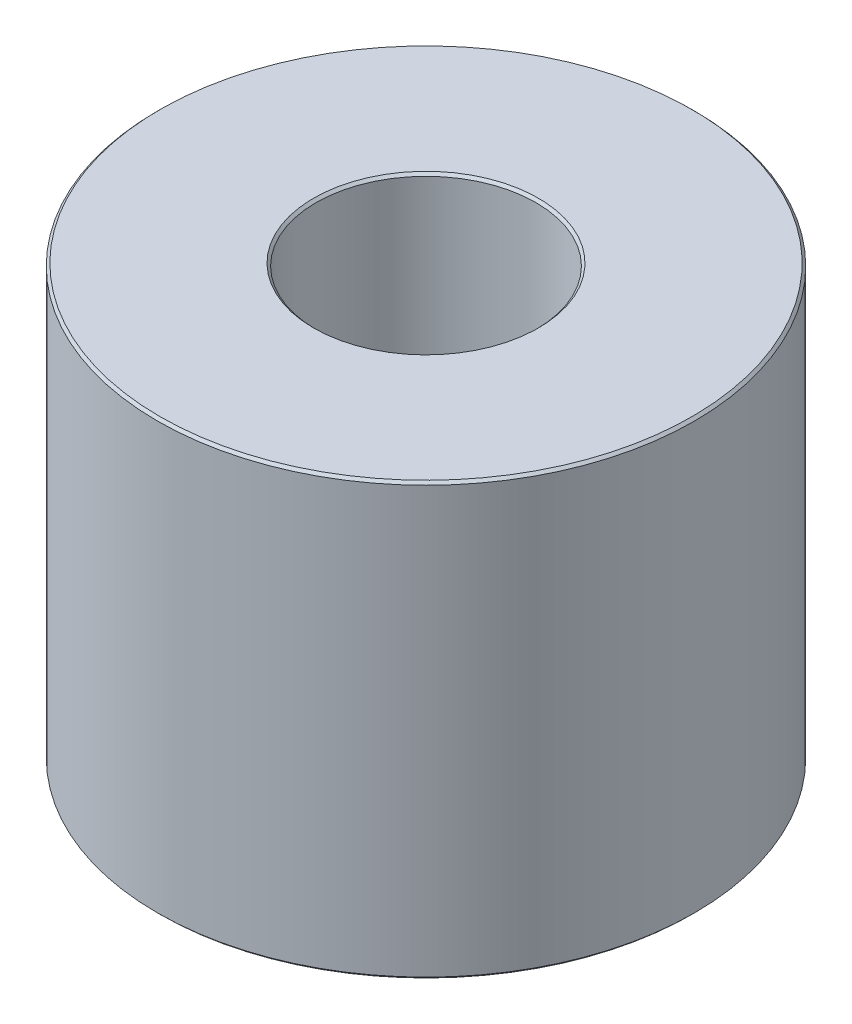
ISO-10303-21;
HEADER;
FILE_DESCRIPTION(('STEP AP214'),'2;1');
FILE_NAME('part.step','',(''),(''),'','','');
FILE_SCHEMA(('AUTOMOTIVE_DESIGN { 1 0 10303 214 1 1 1 1 }'));
ENDSEC;
DATA;
#1=APPLICATION_CONTEXT('core data for automotive mechanical design processes');
#2=APPLICATION_PROTOCOL_DEFINITION('international standard','automotive_design',2000,#1);
#3=PRODUCT_CONTEXT('',#1,'mechanical');
#4=PRODUCT('Part','Part','',(#3));
#5=PRODUCT_RELATED_PRODUCT_CATEGORY('part','',(#4));
#6=PRODUCT_DEFINITION_FORMATION('','',#4);
#7=PRODUCT_DEFINITION_CONTEXT('part definition',#1,'design');
#8=PRODUCT_DEFINITION('design','',#6,#7);
#9=PRODUCT_DEFINITION_SHAPE('','',#8);
#10=(LENGTH_UNIT() NAMED_UNIT(*) SI_UNIT(.MILLI.,.METRE.));
#11=(NAMED_UNIT(*) PLANE_ANGLE_UNIT() SI_UNIT($,.RADIAN.));
#12=(NAMED_UNIT(*) SI_UNIT($,.STERADIAN.) SOLID_ANGLE_UNIT());
#13=UNCERTAINTY_MEASURE_WITH_UNIT(LENGTH_MEASURE(1.E-05),#10,'distance_accuracy_value','');
#14=(GEOMETRIC_REPRESENTATION_CONTEXT(3) GLOBAL_UNCERTAINTY_ASSIGNED_CONTEXT((#13)) GLOBAL_UNIT_ASSIGNED_CONTEXT((#10,
#11,#12)) REPRESENTATION_CONTEXT('',''));
#15=CARTESIAN_POINT('',(0.,0.,0.));
#16=DIRECTION('',(0.,0.,1.));
#17=DIRECTION('',(1.,0.,0.));
#18=AXIS2_PLACEMENT_3D('',#15,#16,#17);
#19=CARTESIAN_POINT('',(0.,84.2794132997244,0.));
#20=DIRECTION('',(0.,-1.,0.));
#21=DIRECTION('',(0.,0.,-1.));
#22=AXIS2_PLACEMENT_3D('',#19,#20,#21);
#23=CYLINDRICAL_SURFACE('',#22,52.5);
#24=CARTESIAN_POINT('',(0.,0.495466436711306,0.));
#25=DIRECTION('',(0.,1.,0.));
#26=DIRECTION('',(0.,0.,1.));
#27=AXIS2_PLACEMENT_3D('',#24,#25,#26);
#28=CIRCLE('',#27,52.5);
#29=CARTESIAN_POINT('',(0.,0.495466436711306,52.5));
#30=VERTEX_POINT('',#29);
#31=EDGE_CURVE('E10',#30,#30,#28,.T.);
#32=ORIENTED_EDGE('',*,*,#31,.T.);
#33=EDGE_LOOP('',(#32));
#34=FACE_BOUND('',#33,.T.);
#35=CARTESIAN_POINT('',(0.,83.783946863013,0.));
#36=DIRECTION('',(0.,1.,0.));
#37=DIRECTION('',(0.,0.,1.));
#38=AXIS2_PLACEMENT_3D('',#35,#36,#37);
#39=CIRCLE('',#38,52.5);
#40=CARTESIAN_POINT('',(0.,83.783946863013,52.5));
#41=VERTEX_POINT('',#40);
#42=EDGE_CURVE('E50',#41,#41,#39,.F.);
#43=ORIENTED_EDGE('',*,*,#42,.T.);
#44=EDGE_LOOP('',(#43));
#45=FACE_BOUND('',#44,.T.);
#46=ADVANCED_FACE('F39',(#34,#45),#23,.T.);
#47=CARTESIAN_POINT('',(0.,84.2794132997244,0.));
#48=DIRECTION('',(0.,1.,0.));
#49=DIRECTION('',(0.,0.,1.));
#50=AXIS2_PLACEMENT_3D('',#47,#48,#49);
#51=PLANE('',#50);
#52=CARTESIAN_POINT('',(0.,84.2794132997244,0.));
#53=DIRECTION('',(0.,1.,0.));
#54=DIRECTION('',(0.,0.,1.));
#55=AXIS2_PLACEMENT_3D('',#52,#53,#54);
#56=CIRCLE('',#55,21.985822478448);
#57=CARTESIAN_POINT('',(0.,84.2794132997244,21.985822478448));
#58=VERTEX_POINT('',#57);
#59=EDGE_CURVE('E58',#58,#58,#56,.F.);
#60=ORIENTED_EDGE('',*,*,#59,.T.);
#61=EDGE_LOOP('',(#60));
#62=FACE_BOUND('',#61,.T.);
#63=CARTESIAN_POINT('',(0.,84.2794132997244,0.));
#64=DIRECTION('',(0.,1.,0.));
#65=DIRECTION('',(0.,0.,1.));
#66=AXIS2_PLACEMENT_3D('',#63,#64,#65);
#67=CIRCLE('',#66,52.0045335632887);
#68=CARTESIAN_POINT('',(0.,84.2794132997244,52.0045335632887));
#69=VERTEX_POINT('',#68);
#70=EDGE_CURVE('E61',#69,#69,#67,.T.);
#71=ORIENTED_EDGE('',*,*,#70,.T.);
#72=EDGE_LOOP('',(#71));
#73=FACE_BOUND('',#72,.T.);
#74=ADVANCED_FACE('F88',(#62,#73),#51,.T.);
#75=CARTESIAN_POINT('',(0.,0.,0.));
#76=DIRECTION('',(0.,1.,0.));
#77=DIRECTION('',(0.,0.,1.));
#78=AXIS2_PLACEMENT_3D('',#75,#76,#77);
#79=PLANE('',#78);
#80=CARTESIAN_POINT('',(0.,0.,0.));
#81=DIRECTION('',(0.,1.,0.));
#82=DIRECTION('',(0.,0.,1.));
#83=AXIS2_PLACEMENT_3D('',#80,#81,#82);
#84=CIRCLE('',#83,21.9858224784481);
#85=CARTESIAN_POINT('',(0.,0.,21.9858224784481));
#86=VERTEX_POINT('',#85);
#87=EDGE_CURVE('E51',#86,#86,#84,.T.);
#88=ORIENTED_EDGE('',*,*,#87,.T.);
#89=EDGE_LOOP('',(#88));
#90=FACE_BOUND('',#89,.T.);
#91=CARTESIAN_POINT('',(0.,0.,0.));
#92=DIRECTION('',(0.,1.,0.));
#93=DIRECTION('',(0.,0.,1.));
#94=AXIS2_PLACEMENT_3D('',#91,#92,#93);
#95=CIRCLE('',#94,52.0045335632887);
#96=CARTESIAN_POINT('',(0.,0.,52.0045335632887));
#97=VERTEX_POINT('',#96);
#98=EDGE_CURVE('E54',#97,#97,#95,.F.);
#99=ORIENTED_EDGE('',*,*,#98,.T.);
#100=EDGE_LOOP('',(#99));
#101=FACE_BOUND('',#100,.T.);
#102=ADVANCED_FACE('F83',(#90,#101),#79,.F.);
#103=CARTESIAN_POINT('',(0.,84.2794132997244,0.));
#104=DIRECTION('',(0.,-1.,0.));
#105=DIRECTION('',(0.,0.,-1.));
#106=AXIS2_PLACEMENT_3D('',#103,#104,#105);
#107=CYLINDRICAL_SURFACE('',#106,21.4903560417368);
#108=CARTESIAN_POINT('',(0.,83.7839468630131,0.));
#109=DIRECTION('',(0.,1.,0.));
#110=DIRECTION('',(0.,0.,1.));
#111=AXIS2_PLACEMENT_3D('',#108,#109,#110);
#112=CIRCLE('',#111,21.4903560417368);
#113=CARTESIAN_POINT('',(0.,83.7839468630131,21.4903560417368));
#114=VERTEX_POINT('',#113);
#115=EDGE_CURVE('E67',#114,#114,#112,.T.);
#116=ORIENTED_EDGE('',*,*,#115,.T.);
#117=EDGE_LOOP('',(#116));
#118=FACE_BOUND('',#117,.T.);
#119=CARTESIAN_POINT('',(0.,0.495466436711334,0.));
#120=DIRECTION('',(0.,1.,0.));
#121=DIRECTION('',(0.,0.,1.));
#122=AXIS2_PLACEMENT_3D('',#119,#120,#121);
#123=CIRCLE('',#122,21.4903560417368);
#124=CARTESIAN_POINT('',(0.,0.495466436711334,21.4903560417368));
#125=VERTEX_POINT('',#124);
#126=EDGE_CURVE('E69',#125,#125,#123,.F.);
#127=ORIENTED_EDGE('',*,*,#126,.T.);
#128=EDGE_LOOP('',(#127));
#129=FACE_BOUND('',#128,.T.);
#130=ADVANCED_FACE('F71',(#118,#129),#107,.F.);
#131=CARTESIAN_POINT('',(0.,83.7839468630131,0.));
#132=DIRECTION('',(0.,1.,0.));
#133=DIRECTION('',(0.,0.,1.));
#134=AXIS2_PLACEMENT_3D('',#131,#132,#133);
#135=CONICAL_SURFACE('',#134,21.4903560417368,0.785398163397452);
#136=ORIENTED_EDGE('',*,*,#59,.F.);
#137=EDGE_LOOP('',(#136));
#138=FACE_BOUND('',#137,.T.);
#139=ORIENTED_EDGE('',*,*,#115,.F.);
#140=EDGE_LOOP('',(#139));
#141=FACE_BOUND('',#140,.T.);
#142=ADVANCED_FACE('F77',(#138,#141),#135,.F.);
#143=CARTESIAN_POINT('',(0.,0.,0.));
#144=DIRECTION('',(0.,-1.,0.));
#145=DIRECTION('',(0.,0.,-1.));
#146=AXIS2_PLACEMENT_3D('',#143,#144,#145);
#147=CONICAL_SURFACE('',#146,21.9858224784481,0.785398163397452);
#148=ORIENTED_EDGE('',*,*,#126,.F.);
#149=EDGE_LOOP('',(#148));
#150=FACE_BOUND('',#149,.T.);
#151=ORIENTED_EDGE('',*,*,#87,.F.);
#152=EDGE_LOOP('',(#151));
#153=FACE_BOUND('',#152,.T.);
#154=ADVANCED_FACE('F73',(#150,#153),#147,.F.);
#155=CARTESIAN_POINT('',(0.,0.495466436711306,0.));
#156=DIRECTION('',(0.,1.,0.));
#157=DIRECTION('',(0.,0.,1.));
#158=AXIS2_PLACEMENT_3D('',#155,#156,#157);
#159=CONICAL_SURFACE('',#158,52.5,0.785398163397455);
#160=ORIENTED_EDGE('',*,*,#98,.F.);
#161=EDGE_LOOP('',(#160));
#162=FACE_BOUND('',#161,.T.);
#163=ORIENTED_EDGE('',*,*,#31,.F.);
#164=EDGE_LOOP('',(#163));
#165=FACE_BOUND('',#164,.T.);
#166=ADVANCED_FACE('F76',(#162,#165),#159,.T.);
#167=CARTESIAN_POINT('',(0.,84.2794132997244,0.));
#168=DIRECTION('',(0.,-1.,0.));
#169=DIRECTION('',(0.,0.,-1.));
#170=AXIS2_PLACEMENT_3D('',#167,#168,#169);
#171=CONICAL_SURFACE('',#170,52.0045335632887,0.785398163397434);
#172=ORIENTED_EDGE('',*,*,#42,.F.);
#173=EDGE_LOOP('',(#172));
#174=FACE_BOUND('',#173,.T.);
#175=ORIENTED_EDGE('',*,*,#70,.F.);
#176=EDGE_LOOP('',(#175));
#177=FACE_BOUND('',#176,.T.);
#178=ADVANCED_FACE('F45',(#174,#177),#171,.T.);
#179=CLOSED_SHELL('',(#46,#74,#102,#130,#142,#154,#166,#178));
#180=MANIFOLD_SOLID_BREP('B2',#179);
#181=ADVANCED_BREP_SHAPE_REPRESENTATION('',(#18,#180),#14);
#182=SHAPE_DEFINITION_REPRESENTATION(#9,#181);
ENDSEC;
END-ISO-10303-21;
